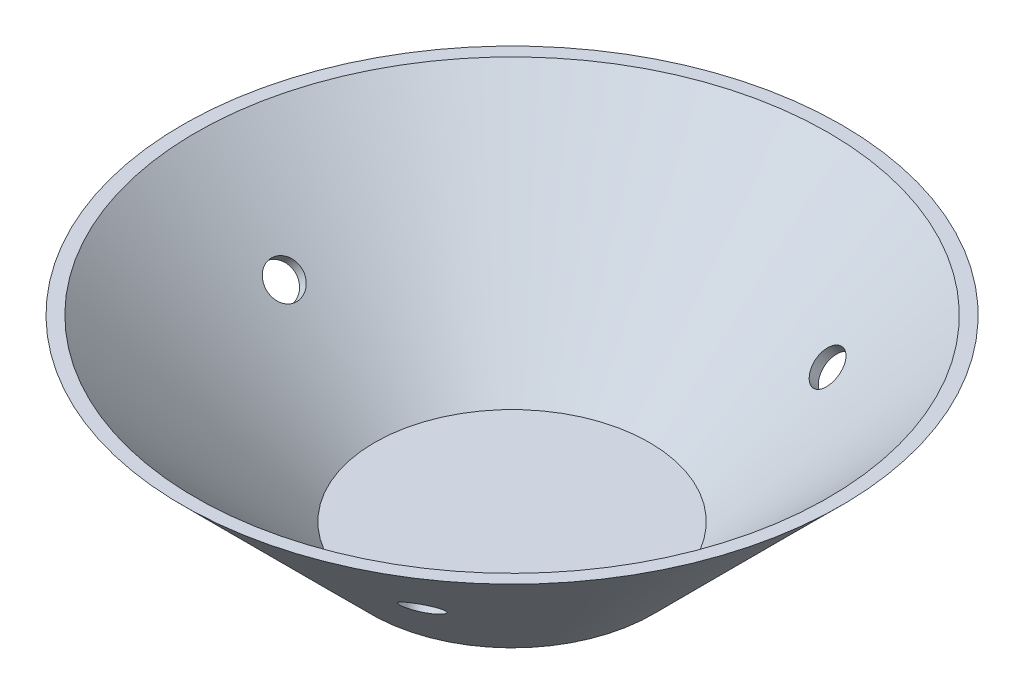
ISO-10303-21;
HEADER;
FILE_DESCRIPTION(('STEP AP214'),'2;1');
FILE_NAME('part.step','',(''),(''),'','','');
FILE_SCHEMA(('AUTOMOTIVE_DESIGN { 1 0 10303 214 1 1 1 1 }'));
ENDSEC;
DATA;
#1=APPLICATION_CONTEXT('core data for automotive mechanical design processes');
#2=APPLICATION_PROTOCOL_DEFINITION('international standard','automotive_design',2000,#1);
#3=PRODUCT_CONTEXT('',#1,'mechanical');
#4=PRODUCT('Part','Part','',(#3));
#5=PRODUCT_RELATED_PRODUCT_CATEGORY('part','',(#4));
#6=PRODUCT_DEFINITION_FORMATION('','',#4);
#7=PRODUCT_DEFINITION_CONTEXT('part definition',#1,'design');
#8=PRODUCT_DEFINITION('design','',#6,#7);
#9=PRODUCT_DEFINITION_SHAPE('','',#8);
#10=(LENGTH_UNIT() NAMED_UNIT(*) SI_UNIT(.MILLI.,.METRE.));
#11=(NAMED_UNIT(*) PLANE_ANGLE_UNIT() SI_UNIT($,.RADIAN.));
#12=(NAMED_UNIT(*) SI_UNIT($,.STERADIAN.) SOLID_ANGLE_UNIT());
#13=UNCERTAINTY_MEASURE_WITH_UNIT(LENGTH_MEASURE(1.E-05),#10,'distance_accuracy_value','');
#14=(GEOMETRIC_REPRESENTATION_CONTEXT(3) GLOBAL_UNCERTAINTY_ASSIGNED_CONTEXT((#13)) GLOBAL_UNIT_ASSIGNED_CONTEXT((#10,
#11,#12)) REPRESENTATION_CONTEXT('',''));
#15=CARTESIAN_POINT('',(0.,0.,0.));
#16=DIRECTION('',(0.,0.,1.));
#17=DIRECTION('',(1.,0.,0.));
#18=AXIS2_PLACEMENT_3D('',#15,#16,#17);
#19=CARTESIAN_POINT('',(0.,0.999999999999998,0.));
#20=DIRECTION('',(0.,1.,0.));
#21=DIRECTION('',(0.,0.,1.));
#22=AXIS2_PLACEMENT_3D('',#19,#20,#21);
#23=CONICAL_SURFACE('',#22,14.5857864376269,0.785398163397447);
#24=CARTESIAN_POINT('',(0.,20.0000000000001,0.));
#25=DIRECTION('',(0.,-1.,0.));
#26=DIRECTION('',(0.,0.,-1.));
#27=AXIS2_PLACEMENT_3D('',#24,#25,#26);
#28=CIRCLE('',#27,33.5857864376269);
#29=CARTESIAN_POINT('',(0.,20.0000000000001,-33.5857864376269));
#30=VERTEX_POINT('',#29);
#31=EDGE_CURVE('E124',#30,#30,#28,.T.);
#32=ORIENTED_EDGE('',*,*,#31,.F.);
#33=EDGE_LOOP('',(#32));
#34=FACE_BOUND('',#33,.T.);
#35=CARTESIAN_POINT('',(0.,0.999999999999998,0.));
#36=DIRECTION('',(0.,-1.,0.));
#37=DIRECTION('',(0.,0.,-1.));
#38=AXIS2_PLACEMENT_3D('',#35,#36,#37);
#39=CIRCLE('',#38,14.5857864376269);
#40=CARTESIAN_POINT('',(0.,0.999999999999998,-14.5857864376269));
#41=VERTEX_POINT('',#40);
#42=EDGE_CURVE('E59',#41,#41,#39,.T.);
#43=ORIENTED_EDGE('',*,*,#42,.T.);
#44=EDGE_LOOP('',(#43));
#45=FACE_BOUND('',#44,.T.);
#46=CARTESIAN_POINT('',(-24.6406632101769,11.1463477237175,-2.12512981659311));
#47=CARTESIAN_POINT('',(-24.7160014883639,11.2199276273625,-2.10791357112872));
#48=CARTESIAN_POINT('',(-24.7907268035602,11.2921626139646,-2.08179534083245));
#49=CARTESIAN_POINT('',(-24.9366835612137,11.4319394334571,-2.01247314817709));
#50=CARTESIAN_POINT('',(-25.0079107467096,11.4994755879025,-1.9692489212256));
#51=CARTESIAN_POINT('',(-25.144619165861,11.6279860245044,-1.86697497360349));
#52=CARTESIAN_POINT('',(-25.2101034431045,11.6889637863611,-1.80793370364531));
#53=CARTESIAN_POINT('',(-25.3333355262826,11.8028127804067,-1.67570718479709));
#54=CARTESIAN_POINT('',(-25.3910851723375,11.8556859411682,-1.60252531020735));
#55=CARTESIAN_POINT('',(-25.4971354689199,11.9520725626238,-1.44398544858415));
#56=CARTESIAN_POINT('',(-25.5454253114426,11.9955753230399,-1.35861372465481));
#57=CARTESIAN_POINT('',(-25.6309524995932,12.0720644304693,-1.17816867897611));
#58=CARTESIAN_POINT('',(-25.6681894345038,12.1050503866898,-1.08309499688602));
#59=CARTESIAN_POINT('',(-25.7304175810259,12.1596864627746,-0.885954256526392));
#60=CARTESIAN_POINT('',(-25.7554103217526,12.1813379981604,-0.783888073330468));
#61=CARTESIAN_POINT('',(-25.7923529970032,12.2127778112003,-0.57565094886943));
#62=CARTESIAN_POINT('',(-25.8043030639588,12.2225662093097,-0.469480049293872));
#63=CARTESIAN_POINT('',(-25.8147682044051,12.2300328280656,-0.256196930097104));
#64=CARTESIAN_POINT('',(-25.8133010175891,12.2277270408242,-0.149086140410133));
#65=CARTESIAN_POINT('',(-25.7970237210349,12.2110963352622,0.0631699352408192));
#66=CARTESIAN_POINT('',(-25.7822136916069,12.1967714892839,0.168315233031139));
#67=CARTESIAN_POINT('',(-25.7397454915866,12.1564645794543,0.373587559774491));
#68=CARTESIAN_POINT('',(-25.7120954677605,12.1304899075836,0.473717726182787));
#69=CARTESIAN_POINT('',(-25.6448395423253,12.0675213682537,0.666195528811332));
#70=CARTESIAN_POINT('',(-25.6052335663695,12.0305274322726,0.758543116632052));
#71=CARTESIAN_POINT('',(-25.5152908748846,11.9463996194509,0.932913549357739));
#72=CARTESIAN_POINT('',(-25.4649457465566,11.8992577927253,1.01492821911096));
#73=CARTESIAN_POINT('',(-25.355127902945,11.7960282264469,1.16622928382012));
#74=CARTESIAN_POINT('',(-25.2956551357129,11.7399404359796,1.23551560632996));
#75=CARTESIAN_POINT('',(-25.1693708282767,11.620186863828,1.3594558890414));
#76=CARTESIAN_POINT('',(-25.102552714183,11.5565142896334,1.41409658896311));
#77=CARTESIAN_POINT('',(-24.9636681446764,11.4232829308324,1.50711059354502));
#78=CARTESIAN_POINT('',(-24.8916017020724,11.3537241605915,1.54548393790483));
#79=CARTESIAN_POINT('',(-24.744415726692,11.2105942994111,1.60485901448494));
#80=CARTESIAN_POINT('',(-24.6692972557259,11.1370246008923,1.62586673487738));
#81=CARTESIAN_POINT('',(-24.5182004063865,10.9878606209172,1.64993159117321));
#82=CARTESIAN_POINT('',(-24.4422220341093,10.9122663538087,1.65298885425329));
#83=CARTESIAN_POINT('',(-24.2916681153418,10.7612514069812,1.6410709724919));
#84=CARTESIAN_POINT('',(-24.2170912647967,10.6858306297018,1.6261135289003));
#85=CARTESIAN_POINT('',(-24.0713477250766,10.5372622788592,1.57862300721274));
#86=CARTESIAN_POINT('',(-24.000181038252,10.4641147068626,1.54608991700415));
#87=CARTESIAN_POINT('',(-23.8631801933769,10.3222548108397,1.46437353170154));
#88=CARTESIAN_POINT('',(-23.79734626551,10.2535426782909,1.41518951836044));
#89=CARTESIAN_POINT('',(-23.6727334992302,10.1226419520853,1.30156791576522));
#90=CARTESIAN_POINT('',(-23.6139547161146,10.0604534095602,1.23713020696633));
#91=CARTESIAN_POINT('',(-23.5048781212092,9.94447284180611,1.09474926382435));
#92=CARTESIAN_POINT('',(-23.4545892801754,9.89068970240723,1.01679191827304));
#93=CARTESIAN_POINT('',(-23.3638000572129,9.7933143537513,0.849624282660688));
#94=CARTESIAN_POINT('',(-23.3232996890227,9.7497221587976,0.760413976805989));
#95=CARTESIAN_POINT('',(-23.2530488310601,9.67414359331489,0.57324992677246));
#96=CARTESIAN_POINT('',(-23.2233001949241,9.64215922401177,0.475294678561528));
#97=CARTESIAN_POINT('',(-23.1752613907972,9.59087020059524,0.273435838080664));
#98=CARTESIAN_POINT('',(-23.1569710995862,9.57156541012874,0.169532309790146));
#99=CARTESIAN_POINT('',(-23.1322897619927,9.54630066054537,-0.0411311826392583));
#100=CARTESIAN_POINT('',(-23.1258836012993,9.54032374899112,-0.147887343153997));
#101=CARTESIAN_POINT('',(-23.125074372337,9.54186466643781,-0.361347432163194));
#102=CARTESIAN_POINT('',(-23.1306712740167,9.54938246165285,-0.468051360787753));
#103=CARTESIAN_POINT('',(-23.1537361279564,9.57764625880995,-0.678308601460909));
#104=CARTESIAN_POINT('',(-23.171196507243,9.59838382147872,-0.78186387939939));
#105=CARTESIAN_POINT('',(-23.217583498148,9.65238209547604,-0.982967147123485));
#106=CARTESIAN_POINT('',(-23.2465102379633,9.6856429468182,-1.08051506973112));
#107=CARTESIAN_POINT('',(-23.3152074363689,9.7636407459605,-1.26697601762286));
#108=CARTESIAN_POINT('',(-23.3549921367573,9.8083927615051,-1.35587749263793));
#109=CARTESIAN_POINT('',(-23.4444460658853,9.90789881007118,-1.52238870611351));
#110=CARTESIAN_POINT('',(-23.494115007,9.96265255204513,-1.5999987730329));
#111=CARTESIAN_POINT('',(-23.6021930828224,10.0804970018177,-1.7418238446267));
#112=CARTESIAN_POINT('',(-23.6606125736432,10.1435975774536,-1.80602275892193));
#113=CARTESIAN_POINT('',(-23.784688724648,10.2761431383636,-1.91909657418103));
#114=CARTESIAN_POINT('',(-23.8503470911912,10.3455896188412,-1.96796785160749));
#115=CARTESIAN_POINT('',(-23.9871319774946,10.488671224635,-2.04895477394687));
#116=CARTESIAN_POINT('',(-24.0582566381059,10.5623049236337,-2.08107608703084));
#117=CARTESIAN_POINT('',(-24.2040057815208,10.711547341551,-2.12763431675563));
#118=CARTESIAN_POINT('',(-24.2786260115621,10.7871536133925,-2.14209217116957));
#119=CARTESIAN_POINT('',(-24.401512409187,10.9103471898132,-2.1509847124583));
#120=CARTESIAN_POINT('',(-24.4493758669092,10.9580107921798,-2.15082854992469));
#121=CARTESIAN_POINT('',(-24.5451290026286,11.0527447988014,-2.14334494051436));
#122=CARTESIAN_POINT('',(-24.5930186805736,11.0998152042363,-2.13601750790253));
#123=CARTESIAN_POINT('',(-24.6406632101769,11.1463477237175,-2.12512981659311));
#124=B_SPLINE_CURVE_WITH_KNOTS('',3,(#46,#47,#48,#49,#50,#51,#52,#53,#54,#55,#56,#57,#58,#59,
#60,#61,#62,#63,#64,#65,#66,#67,#68,#69,#70,#71,#72,#73,#74,#75,#76,#77,#78,#79,#80,#81,#82,#83,
#84,#85,#86,#87,#88,#89,#90,#91,#92,#93,#94,#95,#96,#97,#98,#99,#100,#101,#102,#103,#104,#105,
#106,#107,#108,#109,#110,#111,#112,#113,#114,#115,#116,#117,#118,#119,#120,#121,#122,#123),
.UNSPECIFIED.,.T.,.F.,(4,2,2,2,2,2,2,2,2,2,2,2,2,2,2,2,2,2,2,2,2,2,2,2,2,2,2,2,2,2,2,2,2,2,2,2,
2,2,4),(0.,0.319872641518887,0.640125359464447,0.96020731320374,1.28021298153569,
1.60058215693736,1.92096323551393,2.2413042931162,2.56164209802847,2.88155642790781,
3.20146883224698,3.52117853415364,3.8408902241748,4.1608532946686,4.48081818624356,
4.80107180577816,5.1213246437467,5.44146700310225,5.76160709428729,6.08143287230816,
6.40125887074421,6.72109866681558,7.04094096958695,7.36111914143838,7.68129776266862,
8.00153155751383,8.3217619085867,8.64158470875953,8.96140670821186,9.28102474295312,
9.60064635121295,9.920689221526,10.2407227801616,10.5611381296764,10.8816291701398,
11.2020116862619,11.5220140602218,11.7243044791195,11.9265944956271),.UNSPECIFIED.);
#125=CARTESIAN_POINT('',(-24.6406632101769,11.1463477237175,-2.12512981659311));
#126=VERTEX_POINT('',#125);
#127=EDGE_CURVE('E100',#126,#126,#124,.T.);
#128=ORIENTED_EDGE('',*,*,#127,.F.);
#129=EDGE_LOOP('',(#128));
#130=FACE_BOUND('',#129,.T.);
#131=CARTESIAN_POINT('',(10.7631548142962,10.0142025289661,-21.0027135786498));
#132=CARTESIAN_POINT('',(10.7964562252941,9.95568842487818,-20.9198973842503));
#133=CARTESIAN_POINT('',(10.8377644457191,9.90129935272991,-20.8372889073013));
#134=CARTESIAN_POINT('',(10.935148572984,9.80255573055032,-20.6747094184387));
#135=CARTESIAN_POINT('',(10.9912417316731,9.7582130162833,-20.5947416112701));
#136=CARTESIAN_POINT('',(11.1164780003269,9.68107492367805,-20.4396473107222));
#137=CARTESIAN_POINT('',(11.1856156624249,9.64827474107819,-20.3645188137758));
#138=CARTESIAN_POINT('',(11.3348983503981,9.59529919954497,-20.2210981279931));
#139=CARTESIAN_POINT('',(11.4150406135396,9.575120678952,-20.1528042307294));
#140=CARTESIAN_POINT('',(11.5839449512903,9.5480630095335,-20.0249402094871));
#141=CARTESIAN_POINT('',(11.6726995961413,9.54117250262804,-19.9653626753949));
#142=CARTESIAN_POINT('',(11.8563472096719,9.54088808151589,-19.8565228224839));
#143=CARTESIAN_POINT('',(11.9512403878444,9.54749462816573,-19.8072608559533));
#144=CARTESIAN_POINT('',(12.1444115944305,9.57396890941464,-19.7205113537954));
#145=CARTESIAN_POINT('',(12.2426871575029,9.59382717147199,-19.6830154357334));
#146=CARTESIAN_POINT('',(12.4399541059695,9.64612697565208,-19.6208909961924));
#147=CARTESIAN_POINT('',(12.5389454963387,9.67856860531309,-19.596262564231));
#148=CARTESIAN_POINT('',(12.7350481212108,9.75501027959446,-19.5606706310116));
#149=CARTESIAN_POINT('',(12.832156844819,9.79902475404479,-19.5497242882701));
#150=CARTESIAN_POINT('',(13.0217171176082,9.89716392287295,-19.5420174745805));
#151=CARTESIAN_POINT('',(13.1141686324618,9.95128869175784,-19.545257108179));
#152=CARTESIAN_POINT('',(13.2920204671441,10.0680085685393,-19.5660123858454));
#153=CARTESIAN_POINT('',(13.3774111493037,10.1306149558067,-19.5835471990275));
#154=CARTESIAN_POINT('',(13.5386676168755,10.2622936304871,-19.6325795930421));
#155=CARTESIAN_POINT('',(13.6145334409739,10.3313658916365,-19.6640771171615));
#156=CARTESIAN_POINT('',(13.7545983672173,10.4738234065959,-19.7402415891169));
#157=CARTESIAN_POINT('',(13.818805994098,10.5472054566026,-19.7848988510703));
#158=CARTESIAN_POINT('',(13.9338344553616,10.6961519226755,-19.8862042297921));
#159=CARTESIAN_POINT('',(13.9846554482665,10.7717163128871,-19.9428522045542));
#160=CARTESIAN_POINT('',(14.0713988379358,10.9227115977436,-20.0664448487817));
#161=CARTESIAN_POINT('',(14.1073470398466,10.9981424955798,-20.1333714052178));
#162=CARTESIAN_POINT('',(14.1634381023806,11.1468894444809,-20.2756649353063));
#163=CARTESIAN_POINT('',(14.1835809819677,11.2202054980832,-20.3510318988313));
#164=CARTESIAN_POINT('',(14.2074521664546,11.3627131162721,-20.5079776358902));
#165=CARTESIAN_POINT('',(14.2111836970591,11.4319054887442,-20.5895551855058));
#166=CARTESIAN_POINT('',(14.2020811515692,11.564352993575,-20.7565169831584));
#167=CARTESIAN_POINT('',(14.1892469168497,11.6276080690751,-20.8419012676393));
#168=CARTESIAN_POINT('',(14.1472726575498,11.7466431383146,-21.0140659362807));
#169=CARTESIAN_POINT('',(14.1181076227279,11.8024115035296,-21.1008482630432));
#170=CARTESIAN_POINT('',(14.044198734351,11.904948536192,-21.2730861214812));
#171=CARTESIAN_POINT('',(13.9994547693571,11.9517171392587,-21.3585416436614));
#172=CARTESIAN_POINT('',(13.895514566694,12.0351355531825,-21.5256651496538));
#173=CARTESIAN_POINT('',(13.8363026281306,12.0717742782232,-21.6073289032214));
#174=CARTESIAN_POINT('',(13.7050577430053,12.1339588244247,-21.7643327949097));
#175=CARTESIAN_POINT('',(13.6330248514327,12.1595046931614,-21.8396729601505));
#176=CARTESIAN_POINT('',(13.478181305731,12.1988607731502,-21.9817492691868));
#177=CARTESIAN_POINT('',(13.3953780044441,12.2126789427835,-22.0484912215751));
#178=CARTESIAN_POINT('',(13.2212784157884,12.2282679546661,-22.1714793606767));
#179=CARTESIAN_POINT('',(13.1299821964032,12.2300388933417,-22.2277256313943));
#180=CARTESIAN_POINT('',(12.9416140423425,12.2214934596457,-22.3280468676328));
#181=CARTESIAN_POINT('',(12.8445497695192,12.2111927960409,-22.3721375590579));
#182=CARTESIAN_POINT('',(12.647316603449,12.1787799801345,-22.4470295325776));
#183=CARTESIAN_POINT('',(12.5471477161742,12.1566678505523,-22.4778308402342));
#184=CARTESIAN_POINT('',(12.346605451029,12.1011764501114,-22.5253468731566));
#185=CARTESIAN_POINT('',(12.2462321013522,12.0677986402886,-22.5420634240793));
#186=CARTESIAN_POINT('',(12.0481725081464,11.9905962678603,-22.5610573522393));
#187=CARTESIAN_POINT('',(11.9504862877476,11.9467716153627,-22.5633346052259));
#188=CARTESIAN_POINT('',(11.7605408322208,11.8497137997724,-22.5535154492686));
#189=CARTESIAN_POINT('',(11.6682872840114,11.7964710031887,-22.5414042496729));
#190=CARTESIAN_POINT('',(11.4920091660602,11.6819506215153,-22.5032692556278));
#191=CARTESIAN_POINT('',(11.4079846431362,11.6206729907175,-22.4772453820301));
#192=CARTESIAN_POINT('',(11.2505785930225,11.4916208591642,-22.4121382728942));
#193=CARTESIAN_POINT('',(11.1772032817589,11.4238426020299,-22.3730474538208));
#194=CARTESIAN_POINT('',(11.0433107473688,11.2836085108876,-22.283036009861));
#195=CARTESIAN_POINT('',(10.9827929685019,11.211152879226,-22.2321158964707));
#196=CARTESIAN_POINT('',(10.8764282467531,11.0635851365316,-22.1200216910464));
#197=CARTESIAN_POINT('',(10.830569181937,10.9884752777817,-22.0588561355496));
#198=CARTESIAN_POINT('',(10.7547735148006,10.8376105851365,-21.9280003387537));
#199=CARTESIAN_POINT('',(10.7248406613018,10.7618556036474,-21.858308095128));
#200=CARTESIAN_POINT('',(10.6817620861031,10.6119186686516,-21.7124170364636));
#201=CARTESIAN_POINT('',(10.6686108139756,10.5377362030298,-21.6362203816282));
#202=CARTESIAN_POINT('',(10.6594264740268,10.3931508266263,-21.4794551257431));
#203=CARTESIAN_POINT('',(10.663373520218,10.3227436215507,-21.3988917110779));
#204=CARTESIAN_POINT('',(10.6836137909655,10.212407231779,-21.2653549131118));
#205=CARTESIAN_POINT('',(10.6948876557449,10.1707159756934,-21.2130179536155));
#206=CARTESIAN_POINT('',(10.7240826232487,10.0901959703532,-21.1079972577669));
#207=CARTESIAN_POINT('',(10.7420037300413,10.0513672228506,-21.0553135212025));
#208=CARTESIAN_POINT('',(10.7631548142962,10.0142025289661,-21.0027135786498));
#209=B_SPLINE_CURVE_WITH_KNOTS('',3,(#131,#132,#133,#134,#135,#136,#137,#138,#139,#140,#141,
#142,#143,#144,#145,#146,#147,#148,#149,#150,#151,#152,#153,#154,#155,#156,#157,#158,#159,#160,
#161,#162,#163,#164,#165,#166,#167,#168,#169,#170,#171,#172,#173,#174,#175,#176,#177,#178,#179,
#180,#181,#182,#183,#184,#185,#186,#187,#188,#189,#190,#191,#192,#193,#194,#195,#196,#197,#198,
#199,#200,#201,#202,#203,#204,#205,#206,#207,#208),.UNSPECIFIED.,.T.,.F.,(4,2,2,2,2,2,2,2,2,2,2,
2,2,2,2,2,2,2,2,2,2,2,2,2,2,2,2,2,2,2,2,2,2,2,2,2,2,2,4),(0.,0.319944646134239,
0.640264286171277,0.960450443827837,1.280556364391,1.60038854931185,1.92023165507677,
2.23984637634179,2.55946332109888,2.87948069213132,3.19950042160118,3.51994998860082,
3.84039825402522,4.16061124844833,4.48082045079843,4.8004717179616,5.12012260158986,
5.43971065397625,5.75930176659513,6.07938366954708,6.39946786215314,6.71990097055427,
7.04033270464522,7.3605468204698,7.68075837328903,8.00055369732659,8.32034840623932,
8.64010165719256,8.95985765963041,9.2799426407904,9.60002944291293,9.92030233414132,
10.2405613794193,10.5605548991455,10.8806237078673,11.2005866279023,11.5201775189929,
11.7233872876745,11.9265971807239),.UNSPECIFIED.);
#210=CARTESIAN_POINT('',(10.7631548142962,10.0142025289661,-21.0027135786498));
#211=VERTEX_POINT('',#210);
#212=EDGE_CURVE('E83',#211,#211,#209,.T.);
#213=ORIENTED_EDGE('',*,*,#212,.F.);
#214=EDGE_LOOP('',(#213));
#215=FACE_BOUND('',#214,.T.);
#216=CARTESIAN_POINT('',(11.1245196136692,9.55607693524186,20.2926317596712));
#217=CARTESIAN_POINT('',(11.0376041991586,9.5676628291696,20.353490702471));
#218=CARTESIAN_POINT('',(10.9546918287936,9.58591700028021,20.4189306291199));
#219=CARTESIAN_POINT('',(10.7993400907379,9.63517051936975,20.557172575829));
#220=CARTESIAN_POINT('',(10.7269132944552,9.6661849976919,20.6299832581153));
#221=CARTESIAN_POINT('',(10.5947635029709,9.739908443999,20.7809464353122));
#222=CARTESIAN_POINT('',(10.5350337681891,9.78261118019894,20.8590960670602));
#223=CARTESIAN_POINT('',(10.4300282929366,9.87831482792914,21.0186918929981));
#224=CARTESIAN_POINT('',(10.3847491132067,9.93131328422083,21.1001372975802));
#225=CARTESIAN_POINT('',(10.3099570366474,10.0459883765073,21.2642995264451));
#226=CARTESIAN_POINT('',(10.2804610315413,10.1076742212574,21.3470176158221));
#227=CARTESIAN_POINT('',(10.2382410038598,10.2377586670876,21.5114553334092));
#228=CARTESIAN_POINT('',(10.2255175413617,10.3061574922492,21.5931749281867));
#229=CARTESIAN_POINT('',(10.217290489413,10.4475361888111,21.7533678901349));
#230=CARTESIAN_POINT('',(10.2217762145585,10.5205131898806,21.8318432411079));
#231=CARTESIAN_POINT('',(10.247872916358,10.6689149072585,21.9834495175264));
#232=CARTESIAN_POINT('',(10.2694836656133,10.7443395910522,22.0565805139242));
#233=CARTESIAN_POINT('',(10.3291844015204,10.8953162378715,22.19532251268));
#234=CARTESIAN_POINT('',(10.3672453248966,10.9708677434192,22.2609465205718));
#235=CARTESIAN_POINT('',(10.4587467583969,11.1201058152539,22.3829392301114));
#236=CARTESIAN_POINT('',(10.5121872067401,11.1937923890312,22.4393079689369));
#237=CARTESIAN_POINT('',(10.6328671207094,11.3372639870171,22.5411103482336));
#238=CARTESIAN_POINT('',(10.7001020374635,11.4070502877539,22.5865475827801));
#239=CARTESIAN_POINT('',(10.8464129983559,11.5408974714668,22.6651268442923));
#240=CARTESIAN_POINT('',(10.92548916481,11.6049582952899,22.6982687442392));
#241=CARTESIAN_POINT('',(11.0932956396919,11.7257893178845,22.7512360981862));
#242=CARTESIAN_POINT('',(11.1820400879968,11.7825485663948,22.7710417357139));
#243=CARTESIAN_POINT('',(11.366495852365,11.8872269919258,22.7965590075556));
#244=CARTESIAN_POINT('',(11.4622072189484,11.9351461048343,22.8022705396573));
#245=CARTESIAN_POINT('',(11.6579293071373,12.0210001009055,22.7992968174492));
#246=CARTESIAN_POINT('',(11.7579449628674,12.0589231504444,22.7905945876583));
#247=CARTESIAN_POINT('',(11.95926507873,12.1237718465333,22.7588815513586));
#248=CARTESIAN_POINT('',(12.0605695344713,12.1506975305423,22.7358707935881));
#249=CARTESIAN_POINT('',(12.2614776778452,12.1928757060978,22.6761132892754));
#250=CARTESIAN_POINT('',(12.3610823228938,12.2081349961747,22.6393745612493));
#251=CARTESIAN_POINT('',(12.5557857290612,12.226629940711,22.5531446079942));
#252=CARTESIAN_POINT('',(12.6508845287872,12.2298656982095,22.5036534920543));
#253=CARTESIAN_POINT('',(12.8337390277422,12.2242358757019,22.3933867726461));
#254=CARTESIAN_POINT('',(12.921504268,12.2153862874163,22.3326261732057));
#255=CARTESIAN_POINT('',(13.0873570879117,12.1858284122881,22.2015354246214));
#256=CARTESIAN_POINT('',(13.1654446817825,12.1651201428666,22.1312052895358));
#257=CARTESIAN_POINT('',(13.3097535077226,12.1123569278395,21.9830624836622));
#258=CARTESIAN_POINT('',(13.3759773908798,12.0803045219924,21.9052514905483));
#259=CARTESIAN_POINT('',(13.4947701609722,12.005639995612,21.7444451325447));
#260=CARTESIAN_POINT('',(13.5473389590905,11.9630278063983,21.6614497339384));
#261=CARTESIAN_POINT('',(13.6374583713061,11.8682528468256,21.4926678237484));
#262=CARTESIAN_POINT('',(13.6749939071953,11.8160805638316,21.4068786027531));
#263=CARTESIAN_POINT('',(13.7339921336801,11.7035272141326,21.2351579367661));
#264=CARTESIAN_POINT('',(13.7554547489893,11.6431461089786,21.1492264911101));
#265=CARTESIAN_POINT('',(13.7817859261821,11.5156827169235,20.9797387396421));
#266=CARTESIAN_POINT('',(13.7866439342232,11.448596195945,20.8961839778839));
#267=CARTESIAN_POINT('',(13.7796640707946,11.3095171429269,20.7340001248586));
#268=CARTESIAN_POINT('',(13.7678262979143,11.2375246398598,20.6553710045081));
#269=CARTESIAN_POINT('',(13.7278521425755,11.0906252009903,20.5054139255536));
#270=CARTESIAN_POINT('',(13.699726649512,11.015720243534,20.434081126341));
#271=CARTESIAN_POINT('',(13.6280092023995,10.8650272320585,20.3007318108635));
#272=CARTESIAN_POINT('',(13.5844173129231,10.7892391817275,20.2387152557045));
#273=CARTESIAN_POINT('',(13.4830480252213,10.6390043994656,20.1258048054964));
#274=CARTESIAN_POINT('',(13.4252826381802,10.5645565888049,20.074901561255));
#275=CARTESIAN_POINT('',(13.2971562408302,10.4191129118176,19.9855356386981));
#276=CARTESIAN_POINT('',(13.2267951633595,10.3481170638999,19.9470730267207));
#277=CARTESIAN_POINT('',(13.0753793929342,10.2116767402071,19.8835556236146));
#278=CARTESIAN_POINT('',(12.9943199196677,10.1462347676471,19.85850685158));
#279=CARTESIAN_POINT('',(12.8237480594602,10.022953352005,19.8224081759143));
#280=CARTESIAN_POINT('',(12.7342359286974,9.96511367864376,19.8113578481727));
#281=CARTESIAN_POINT('',(12.5491088522146,9.85880830331228,19.8033996740111));
#282=CARTESIAN_POINT('',(12.453488430392,9.81035117423262,19.8065046984509));
#283=CARTESIAN_POINT('',(12.258804317966,9.72443140660897,19.8266408631011));
#284=CARTESIAN_POINT('',(12.1597398094105,9.68697140004942,19.8436753334138));
#285=CARTESIAN_POINT('',(11.9609116904614,9.62429092711801,19.8910467579214));
#286=CARTESIAN_POINT('',(11.8611479627634,9.59907256686249,19.9213859994304));
#287=CARTESIAN_POINT('',(11.6637897314542,9.56175443376267,19.9943826244368));
#288=CARTESIAN_POINT('',(11.566192797644,9.54963915243238,20.0370253698773));
#289=CARTESIAN_POINT('',(11.410925824132,9.54085297399604,20.1155856658814));
#290=CARTESIAN_POINT('',(11.3517678573122,9.5401416614266,20.1482123599289));
#291=CARTESIAN_POINT('',(11.2360462027054,9.54409034802529,20.2174926571033));
#292=CARTESIAN_POINT('',(11.1794825101851,9.5487503373929,20.2541462528826));
#293=CARTESIAN_POINT('',(11.1245196136692,9.55607693524186,20.2926317596712));
#294=B_SPLINE_CURVE_WITH_KNOTS('',3,(#216,#217,#218,#219,#220,#221,#222,#223,#224,#225,#226,
#227,#228,#229,#230,#231,#232,#233,#234,#235,#236,#237,#238,#239,#240,#241,#242,#243,#244,#245,
#246,#247,#248,#249,#250,#251,#252,#253,#254,#255,#256,#257,#258,#259,#260,#261,#262,#263,#264,
#265,#266,#267,#268,#269,#270,#271,#272,#273,#274,#275,#276,#277,#278,#279,#280,#281,#282,#283,
#284,#285,#286,#287,#288,#289,#290,#291,#292,#293),.UNSPECIFIED.,.T.,.F.,(4,2,2,2,2,2,2,2,2,2,2,
2,2,2,2,2,2,2,2,2,2,2,2,2,2,2,2,2,2,2,2,2,2,2,2,2,2,2,4),(0.,0.319957992587326,
0.640296468988953,0.96046448329194,1.28055624008091,1.60098988890088,1.92143423753578,
2.24167965040241,2.56192081088412,2.88159848472195,3.20127487440384,3.52084601635636,
3.84042045958991,4.16046871962227,4.48051930068161,4.80094708213819,5.12137377214783,
5.44161359254574,5.76185066854977,6.08166440683029,6.40147767528549,6.72121938825623,
7.04096318087169,7.36102687490121,7.68109206811368,8.00136065608616,8.32162735286555,
8.64168017742156,8.96173166576378,9.28151286090014,9.60129576120188,9.92122203535949,
10.2411386164846,10.5613461421382,10.8816302419522,11.2019694255918,11.5219290472303,
11.7242619731249,11.9265945298419),.UNSPECIFIED.);
#295=CARTESIAN_POINT('',(11.1245196136692,9.55607693524186,20.2926317596712));
#296=VERTEX_POINT('',#295);
#297=EDGE_CURVE('E89',#296,#296,#294,.T.);
#298=ORIENTED_EDGE('',*,*,#297,.F.);
#299=EDGE_LOOP('',(#298));
#300=FACE_BOUND('',#299,.T.);
#301=ADVANCED_FACE('F39',(#34,#45,#130,#215,#300),#23,.F.);
#302=CARTESIAN_POINT('',(0.,0.,0.));
#303=DIRECTION('',(0.,1.,0.));
#304=DIRECTION('',(0.,0.,1.));
#305=AXIS2_PLACEMENT_3D('',#302,#303,#304);
#306=CONICAL_SURFACE('',#305,15.,0.785398163397447);
#307=CARTESIAN_POINT('',(0.,20.0000000000001,0.));
#308=DIRECTION('',(0.,-1.,0.));
#309=DIRECTION('',(0.,0.,-1.));
#310=AXIS2_PLACEMENT_3D('',#307,#308,#309);
#311=CIRCLE('',#310,35.);
#312=CARTESIAN_POINT('',(0.,20.0000000000001,-35.));
#313=VERTEX_POINT('',#312);
#314=EDGE_CURVE('E122',#313,#313,#311,.T.);
#315=ORIENTED_EDGE('',*,*,#314,.T.);
#316=EDGE_LOOP('',(#315));
#317=FACE_BOUND('',#316,.T.);
#318=CARTESIAN_POINT('',(0.,0.,0.));
#319=DIRECTION('',(0.,-1.,0.));
#320=DIRECTION('',(0.,0.,-1.));
#321=AXIS2_PLACEMENT_3D('',#318,#319,#320);
#322=CIRCLE('',#321,15.);
#323=CARTESIAN_POINT('',(0.,0.,-15.));
#324=VERTEX_POINT('',#323);
#325=EDGE_CURVE('E106',#324,#324,#322,.T.);
#326=ORIENTED_EDGE('',*,*,#325,.F.);
#327=EDGE_LOOP('',(#326));
#328=FACE_BOUND('',#327,.T.);
#329=CARTESIAN_POINT('',(-24.5067615542216,9.58236650500407,-1.92649451358445));
#330=CARTESIAN_POINT('',(-24.5713811709504,9.65071620835305,-1.97663357337165));
#331=CARTESIAN_POINT('',(-24.6392963558056,9.72185372297221,-2.01888453093729));
#332=CARTESIAN_POINT('',(-24.779890409143,9.86754922322285,-2.08633947774065));
#333=CARTESIAN_POINT('',(-24.8525746754706,9.94211105498011,-2.11152377200943));
#334=CARTESIAN_POINT('',(-25.0006302092819,10.0923978736637,-2.14406625148622));
#335=CARTESIAN_POINT('',(-25.0760003303882,10.1681223566748,-2.15143195171102));
#336=CARTESIAN_POINT('',(-25.2272913104499,10.3185836234659,-2.14814137906352));
#337=CARTESIAN_POINT('',(-25.3032120339838,10.3933206381532,-2.137489397355));
#338=CARTESIAN_POINT('',(-25.4533867846047,10.5397317494322,-2.09848769076295));
#339=CARTESIAN_POINT('',(-25.5276414194214,10.6114069717716,-2.07014453139495));
#340=CARTESIAN_POINT('',(-25.6723129517023,10.7497995212083,-1.99657464131461));
#341=CARTESIAN_POINT('',(-25.7427296777622,10.8165166269198,-1.95134715723999));
#342=CARTESIAN_POINT('',(-25.8776762068944,10.9433165008803,-1.84523310637841));
#343=CARTESIAN_POINT('',(-25.9421991823311,11.0033915911908,-1.78432868263408));
#344=CARTESIAN_POINT('',(-26.0632900638213,11.115280570958,-1.64861119764719));
#345=CARTESIAN_POINT('',(-26.1198579154295,11.1670944038745,-1.57379804122055));
#346=CARTESIAN_POINT('',(-26.2233530770206,11.2612215438971,-1.41226560515193));
#347=CARTESIAN_POINT('',(-26.2702671629805,11.3035218263235,-1.32553026168922));
#348=CARTESIAN_POINT('',(-26.3528796390305,11.3774773315303,-1.14268628635125));
#349=CARTESIAN_POINT('',(-26.3885780610707,11.4091325846351,-1.04657768117855));
#350=CARTESIAN_POINT('',(-26.4476167140187,11.4610091307015,-0.847731346428968));
#351=CARTESIAN_POINT('',(-26.4709595006956,11.4812327883529,-0.744994992741477));
#352=CARTESIAN_POINT('',(-26.5045488374761,11.5097561016068,-0.535793767678413));
#353=CARTESIAN_POINT('',(-26.5147954808105,11.5180558420952,-0.429328922851323));
#354=CARTESIAN_POINT('',(-26.5218587068375,11.5225222695006,-0.215836956220553));
#355=CARTESIAN_POINT('',(-26.5186922927904,11.5187043191267,-0.108810717965915));
#356=CARTESIAN_POINT('',(-26.4990722279773,11.4990605315875,0.102895792574225));
#357=CARTESIAN_POINT('',(-26.4826186273951,11.4832347397741,0.207576073718515));
#358=CARTESIAN_POINT('',(-26.4369682968885,11.4399739255007,0.411564611082538));
#359=CARTESIAN_POINT('',(-26.4077781253949,11.412544878116,0.510875602564834));
#360=CARTESIAN_POINT('',(-26.3375912694372,11.3467532150768,0.701371357600119));
#361=CARTESIAN_POINT('',(-26.2965945210013,11.3083905401806,0.792556077118859));
#362=CARTESIAN_POINT('',(-26.204056870709,11.2216475921818,0.964290431887982));
#363=CARTESIAN_POINT('',(-26.1525075253163,11.1732592968185,1.04483146526541));
#364=CARTESIAN_POINT('',(-26.0405011873362,11.0676984451311,1.19291457158215));
#365=CARTESIAN_POINT('',(-25.9800441468392,11.0105258415609,1.26045657460222));
#366=CARTESIAN_POINT('',(-25.8520403185231,10.8888053016399,1.38067824010762));
#367=CARTESIAN_POINT('',(-25.7844878731268,10.8242514761234,1.43334591710254));
#368=CARTESIAN_POINT('',(-25.6443944755368,10.6894892527972,1.52224949964953));
#369=CARTESIAN_POINT('',(-25.5718535380782,10.6192808716897,1.55848545373483));
#370=CARTESIAN_POINT('',(-25.4239888611744,10.4751152400355,1.61348112956622));
#371=CARTESIAN_POINT('',(-25.3486662617338,10.4011595207315,1.63224792981956));
#372=CARTESIAN_POINT('',(-25.1974240375056,10.2515025359937,1.65179362165624));
#373=CARTESIAN_POINT('',(-25.121504416671,10.1758012821114,1.65257263224353));
#374=CARTESIAN_POINT('',(-24.9713146886887,10.0248568477473,1.63612783263503));
#375=CARTESIAN_POINT('',(-24.8970431460174,9.94961331367188,1.61892037262263));
#376=CARTESIAN_POINT('',(-24.7521462283882,9.80169034541291,1.56701909009579));
#377=CARTESIAN_POINT('',(-24.6815208595478,9.72901091553152,1.53232523824319));
#378=CARTESIAN_POINT('',(-24.5458123385209,9.58836267336121,1.44643354863876));
#379=CARTESIAN_POINT('',(-24.4807299188187,9.52039448386914,1.39523353391055));
#380=CARTESIAN_POINT('',(-24.357814507343,9.39124465842963,1.27778384956076));
#381=CARTESIAN_POINT('',(-24.299981562671,9.33006306657669,1.21153408216512));
#382=CARTESIAN_POINT('',(-24.1929708841066,9.21633355376214,1.06578622660358));
#383=CARTESIAN_POINT('',(-24.1438018321201,9.16379429656785,0.98627500293165));
#384=CARTESIAN_POINT('',(-24.05539648217,9.06909902879555,0.816301043274071));
#385=CARTESIAN_POINT('',(-24.0161602034066,9.02694303828851,0.725838286119478));
#386=CARTESIAN_POINT('',(-23.9485591503546,8.95438506670218,0.536518253097159));
#387=CARTESIAN_POINT('',(-23.9201950009636,8.92398376124628,0.437660495108603));
#388=CARTESIAN_POINT('',(-23.8750109473049,8.87594643767718,0.23436285739957));
#389=CARTESIAN_POINT('',(-23.8581909568965,8.85831032431203,0.129923019337974));
#390=CARTESIAN_POINT('',(-23.8365019132145,8.83640719087782,-0.0814368618631023));
#391=CARTESIAN_POINT('',(-23.8316183552071,8.83212394312887,-0.18835373527041));
#392=CARTESIAN_POINT('',(-23.8338756492357,8.83702265385594,-0.401746762288691));
#393=CARTESIAN_POINT('',(-23.8410160052924,8.84620405692096,-0.50822293389674));
#394=CARTESIAN_POINT('',(-23.8671504823618,8.87770946355656,-0.717653116621351));
#395=CARTESIAN_POINT('',(-23.8861376044324,8.90002570676393,-0.820609169531399));
#396=CARTESIAN_POINT('',(-23.9355312446187,8.95705863152517,-1.020181383567));
#397=CARTESIAN_POINT('',(-23.9659406219959,8.9917784178737,-1.11679595014837));
#398=CARTESIAN_POINT('',(-24.0375247626064,9.07254154382445,-1.30108835850105));
#399=CARTESIAN_POINT('',(-24.0787184567414,9.11860478732571,-1.38875010445086));
#400=CARTESIAN_POINT('',(-24.1708354183143,9.22050771337176,-1.55239733057241));
#401=CARTESIAN_POINT('',(-24.2217473281354,9.27633597728899,-1.62839625579946));
#402=CARTESIAN_POINT('',(-24.3120012694721,9.37426245869032,-1.74154839114706));
#403=CARTESIAN_POINT('',(-24.348849888856,9.41400443215756,-1.782798138507));
#404=CARTESIAN_POINT('',(-24.4256052227418,9.49624110592021,-1.85926819446079));
#405=CARTESIAN_POINT('',(-24.4655119421911,9.53873581066893,-1.89448849329996));
#406=CARTESIAN_POINT('',(-24.5067615542216,9.58236650500407,-1.92649451358445));
#407=B_SPLINE_CURVE_WITH_KNOTS('',3,(#329,#330,#331,#332,#333,#334,#335,#336,#337,#338,#339,
#340,#341,#342,#343,#344,#345,#346,#347,#348,#349,#350,#351,#352,#353,#354,#355,#356,#357,#358,
#359,#360,#361,#362,#363,#364,#365,#366,#367,#368,#369,#370,#371,#372,#373,#374,#375,#376,#377,
#378,#379,#380,#381,#382,#383,#384,#385,#386,#387,#388,#389,#390,#391,#392,#393,#394,#395,#396,
#397,#398,#399,#400,#401,#402,#403,#404,#405,#406),.UNSPECIFIED.,.T.,.F.,(4,2,2,2,2,2,2,2,2,2,2,
2,2,2,2,2,2,2,2,2,2,2,2,2,2,2,2,2,2,2,2,2,2,2,2,2,2,2,4),(0.,0.319520563076359,
0.639409228564506,0.959162957024627,1.27884054236958,1.59839956007054,1.91797283789118,
2.237911751867,2.55785285541761,2.87822934864245,3.19860492920458,3.51891421400048,
3.83922121851803,4.15912230272607,4.47902217872206,4.79875752300788,5.11849459975477,
5.43848851741328,5.75848415620852,6.07873691136828,6.39898872061361,6.71911070715413,
7.03923057582525,7.35905969982173,7.67888936041996,7.99876122020532,8.31863515816866,
8.6388278344445,8.95902112965165,9.27923282585646,9.59944213266532,9.91926213848031,
10.23906895223,10.5586870062197,10.8783851215703,11.1986482458336,11.5185393471966,
11.7225033848503,11.9264677524818),.UNSPECIFIED.);
#408=CARTESIAN_POINT('',(-24.5067615542216,9.58236650500407,-1.92649451358445));
#409=VERTEX_POINT('',#408);
#410=EDGE_CURVE('E55',#409,#409,#407,.T.);
#411=ORIENTED_EDGE('',*,*,#410,.T.);
#412=EDGE_LOOP('',(#411));
#413=FACE_BOUND('',#412,.T.);
#414=CARTESIAN_POINT('',(11.0257208831668,9.83291197824814,-22.2509998949692));
#415=CARTESIAN_POINT('',(11.0152525569808,9.75948644502921,-22.1742421418053));
#416=CARTESIAN_POINT('',(11.0132886385129,9.68750145648755,-22.0948407843784));
#417=CARTESIAN_POINT('',(11.0264143854684,9.54861081856238,-21.9329486517469));
#418=CARTESIAN_POINT('',(11.0415242739074,9.4817112928985,-21.8504543250795));
#419=CARTESIAN_POINT('',(11.0882995398023,9.3551309847122,-21.6846816186006));
#420=CARTESIAN_POINT('',(11.1199566459247,9.2954466139404,-21.6014036509065));
#421=CARTESIAN_POINT('',(11.1988273629542,9.18514941231816,-21.4362551078508));
#422=CARTESIAN_POINT('',(11.2460372164523,9.13453439494599,-21.3543841975779));
#423=CARTESIAN_POINT('',(11.3546146146023,9.04395306679382,-21.1941432845682));
#424=CARTESIAN_POINT('',(11.4159891925445,9.00399206742817,-21.1157750441834));
#425=CARTESIAN_POINT('',(11.5510627701577,8.93605854157694,-20.9646595607593));
#426=CARTESIAN_POINT('',(11.6247621544369,8.90808638931258,-20.8919124932382));
#427=CARTESIAN_POINT('',(11.7822554040518,8.86508120973349,-20.7540605592392));
#428=CARTESIAN_POINT('',(11.866040290525,8.85003676892975,-20.6889489955588));
#429=CARTESIAN_POINT('',(12.0413362872229,8.83334906214585,-20.5680822777314));
#430=CARTESIAN_POINT('',(12.1328473242095,8.83170566914821,-20.5123270349085));
#431=CARTESIAN_POINT('',(12.3208860460706,8.8418671641046,-20.4118036333157));
#432=CARTESIAN_POINT('',(12.4174082820128,8.85365772529051,-20.3670238315179));
#433=CARTESIAN_POINT('',(12.6128498242357,8.89026529980361,-20.2896898202494));
#434=CARTESIAN_POINT('',(12.711769138295,8.91508235540713,-20.2571356504565));
#435=CARTESIAN_POINT('',(12.909331074295,8.97693768593211,-20.2052519157444));
#436=CARTESIAN_POINT('',(13.0079734661321,9.01398414730666,-20.1859312361317));
#437=CARTESIAN_POINT('',(13.2022102537503,9.09908164201601,-20.1612293705723));
#438=CARTESIAN_POINT('',(13.2978046140327,9.14713280346261,-20.1558483469137));
#439=CARTESIAN_POINT('',(13.4834836708315,9.2527808511996,-20.1593378692351));
#440=CARTESIAN_POINT('',(13.5735596798553,9.31039228492086,-20.1682303161421));
#441=CARTESIAN_POINT('',(13.7455830592307,9.43329655404875,-20.200218274841));
#442=CARTESIAN_POINT('',(13.8275304361235,9.49858938327387,-20.2233137752033));
#443=CARTESIAN_POINT('',(13.9810468999759,9.63484542234547,-20.283197335227));
#444=CARTESIAN_POINT('',(14.0526163778206,9.70580841846798,-20.3199848789892));
#445=CARTESIAN_POINT('',(14.1833992731576,9.85127216176295,-20.406316890385));
#446=CARTESIAN_POINT('',(14.2426128226112,9.92577287114217,-20.4558612217635));
#447=CARTESIAN_POINT('',(14.346940013011,10.0760018704114,-20.5662662944984));
#448=CARTESIAN_POINT('',(14.3920764205131,10.1517279676381,-20.6271085071413));
#449=CARTESIAN_POINT('',(14.4670985145892,10.3023651577718,-20.7584389121123));
#450=CARTESIAN_POINT('',(14.4969842813905,10.3772762549641,-20.8289270536947));
#451=CARTESIAN_POINT('',(14.5406167900621,10.5241448954698,-20.9774408722724));
#452=CARTESIAN_POINT('',(14.5543764928792,10.596104765807,-21.05546044139));
#453=CARTESIAN_POINT('',(14.5653689185545,10.7351969089363,-21.216787651317));
#454=CARTESIAN_POINT('',(14.5626015261028,10.8023291480425,-21.3000953290176));
#455=CARTESIAN_POINT('',(14.5405459111253,10.9300768218568,-21.4696210209773));
#456=CARTESIAN_POINT('',(14.5212393205843,10.9906849267559,-21.5558421685622));
#457=CARTESIAN_POINT('',(14.4665539477055,11.1037439983947,-21.7285356885982));
#458=CARTESIAN_POINT('',(14.4311750239543,11.1561948933573,-21.8150080632529));
#459=CARTESIAN_POINT('',(14.3452048161327,11.2516851497737,-21.9857436870835));
#460=CARTESIAN_POINT('',(14.294592423277,11.2947113076454,-22.0700036933213));
#461=CARTESIAN_POINT('',(14.179529443256,11.3701861226073,-22.2336734144886));
#462=CARTESIAN_POINT('',(14.1150788604851,11.4026347830564,-22.3130831309582));
#463=CARTESIAN_POINT('',(13.9741122855368,11.4561472379142,-22.4646811891276));
#464=CARTESIAN_POINT('',(13.897598040157,11.4772126786414,-22.5368705738495));
#465=CARTESIAN_POINT('',(13.7346262347159,11.5074448703403,-22.6719130550736));
#466=CARTESIAN_POINT('',(13.6481687653185,11.5166117297956,-22.7347662366927));
#467=CARTESIAN_POINT('',(13.4678646126828,11.5228153667553,-22.8492392980702));
#468=CARTESIAN_POINT('',(13.3740273828499,11.5198674227386,-22.9008732403541));
#469=CARTESIAN_POINT('',(13.1815411600397,11.5019461303683,-22.9915497924798));
#470=CARTESIAN_POINT('',(13.0828921763277,11.4869728051695,-23.0305924265659));
#471=CARTESIAN_POINT('',(12.883672583182,11.4453790085676,-23.0950119935365));
#472=CARTESIAN_POINT('',(12.7831030934838,11.418765137072,-23.1203966520006));
#473=CARTESIAN_POINT('',(12.5828892312482,11.3545460893786,-23.1569067611013));
#474=CARTESIAN_POINT('',(12.483244865125,11.3169408370324,-23.1680321129466));
#475=CARTESIAN_POINT('',(12.2876908965318,11.2316368631316,-23.1758322039627));
#476=CARTESIAN_POINT('',(12.1917843042072,11.183930197666,-23.1724955295214));
#477=CARTESIAN_POINT('',(12.006583574435,11.0796392183138,-23.1515768316155));
#478=CARTESIAN_POINT('',(11.9172892232883,11.0230551915164,-23.1339952687466));
#479=CARTESIAN_POINT('',(11.7478534018271,10.9024055956618,-23.0852053140592));
#480=CARTESIAN_POINT('',(11.6677186686917,10.8383345888632,-23.0539869723165));
#481=CARTESIAN_POINT('',(11.5190068392179,10.7043932602972,-22.9789203262793));
#482=CARTESIAN_POINT('',(11.4504325116304,10.6345215552088,-22.9350690031418));
#483=CARTESIAN_POINT('',(11.3268717194879,10.4908586821914,-22.8360891249112));
#484=CARTESIAN_POINT('',(11.271886674547,10.4170671057477,-22.7809593927097));
#485=CARTESIAN_POINT('',(11.1771656941621,10.267646517018,-22.6610942893844));
#486=CARTESIAN_POINT('',(11.1374118262383,10.1920197776617,-22.5963703393954));
#487=CARTESIAN_POINT('',(11.0858378750956,10.0688140090943,-22.4844305449349));
#488=CARTESIAN_POINT('',(11.0691207321758,10.0211326166797,-22.4395123528748));
#489=CARTESIAN_POINT('',(11.0423742911111,9.92641254246215,-22.3470822405529));
#490=CARTESIAN_POINT('',(11.0323449839378,9.87937385979155,-22.2995703237928));
#491=CARTESIAN_POINT('',(11.0257208831668,9.83291197824814,-22.2509998949692));
#492=B_SPLINE_CURVE_WITH_KNOTS('',3,(#414,#415,#416,#417,#418,#419,#420,#421,#422,#423,#424,
#425,#426,#427,#428,#429,#430,#431,#432,#433,#434,#435,#436,#437,#438,#439,#440,#441,#442,#443,
#444,#445,#446,#447,#448,#449,#450,#451,#452,#453,#454,#455,#456,#457,#458,#459,#460,#461,#462,
#463,#464,#465,#466,#467,#468,#469,#470,#471,#472,#473,#474,#475,#476,#477,#478,#479,#480,#481,
#482,#483,#484,#485,#486,#487,#488,#489,#490,#491),.UNSPECIFIED.,.T.,.F.,(4,2,2,2,2,2,2,2,2,2,2,
2,2,2,2,2,2,2,2,2,2,2,2,2,2,2,2,2,2,2,2,2,2,2,2,2,2,2,4),(0.,0.319962454628187,
0.640304285363473,0.960486142144637,1.28059070242104,1.60085454928129,1.92112839216552,
2.24111918350057,2.56110694190308,2.8807537654753,3.20040162643983,3.52026389738555,
3.8401298922141,4.16048715235117,4.48084415468716,4.80118908759054,5.12153059903326,
5.44135131216072,5.76117034282924,6.08073214976736,6.4002961862965,6.72021558333539,
7.04013779525776,7.36050537556451,7.68087285414005,8.00119398658834,8.32151219853321,
8.64142656800118,8.9613403214756,9.28107292625554,9.60080774619551,9.92079495078332,
10.2407718092843,10.5609825263357,10.8812698261708,11.201590570918,11.5215330174478,
11.7239977062626,11.9264621217534),.UNSPECIFIED.);
#493=CARTESIAN_POINT('',(11.0257208831668,9.83291197824814,-22.2509998949692));
#494=VERTEX_POINT('',#493);
#495=EDGE_CURVE('E51',#494,#494,#492,.T.);
#496=ORIENTED_EDGE('',*,*,#495,.T.);
#497=EDGE_LOOP('',(#496));
#498=FACE_BOUND('',#497,.T.);
#499=CARTESIAN_POINT('',(10.6677600984239,9.33724601682697,21.8746528696122));
#500=CARTESIAN_POINT('',(10.6355944159753,9.39708190820709,21.9569116798307));
#501=CARTESIAN_POINT('',(10.6114612593122,9.46096371984752,22.0394660617725));
#502=CARTESIAN_POINT('',(10.5800881145036,9.59483364143622,22.202928652005));
#503=CARTESIAN_POINT('',(10.5728677461773,9.6648287456624,22.2838348405955));
#504=CARTESIAN_POINT('',(10.5756351217665,9.80874674769378,22.4417227136367));
#505=CARTESIAN_POINT('',(10.5856160840119,9.88266808643546,22.5187059324096));
#506=CARTESIAN_POINT('',(10.6225356289395,10.0322614010929,22.6666289304288));
#507=CARTESIAN_POINT('',(10.6494700309763,10.1079329409865,22.7375701947));
#508=CARTESIAN_POINT('',(10.7194995387471,10.2587947019195,22.8713586788054));
#509=CARTESIAN_POINT('',(10.762577747394,10.333985342898,22.9342142695189));
#510=CARTESIAN_POINT('',(10.8636546081783,10.4818715088082,23.0501024232492));
#511=CARTESIAN_POINT('',(10.9216538349168,10.5545669375282,23.1031346078361));
#512=CARTESIAN_POINT('',(11.0508764916066,10.6954890998138,23.1977957810968));
#513=CARTESIAN_POINT('',(11.1220998478532,10.7637158582826,23.2394248333227));
#514=CARTESIAN_POINT('',(11.2756868959545,10.8939028904429,23.3099975452463));
#515=CARTESIAN_POINT('',(11.3580506705353,10.9558631175947,23.338941110738));
#516=CARTESIAN_POINT('',(11.5316462776603,11.0720112477797,23.3832322609291));
#517=CARTESIAN_POINT('',(11.6228913497189,11.1261872395789,23.3985591916852));
#518=CARTESIAN_POINT('',(11.8114839378793,11.2252847568015,23.4149717056421));
#519=CARTESIAN_POINT('',(11.9088314791735,11.2702062440167,23.4160572300469));
#520=CARTESIAN_POINT('',(12.1068899111935,11.3497095579409,23.4038174504034));
#521=CARTESIAN_POINT('',(12.2076037137366,11.384282161319,23.390479339983));
#522=CARTESIAN_POINT('',(12.409391734104,11.4421763347263,23.3496346132154));
#523=CARTESIAN_POINT('',(12.5104659505488,11.4654979477727,23.3221280510411));
#524=CARTESIAN_POINT('',(12.7099777243286,11.5002999543997,23.2536700448635));
#525=CARTESIAN_POINT('',(12.8084172739172,11.5117895563861,23.2127290891142));
#526=CARTESIAN_POINT('',(12.9999169908036,11.522674775105,23.118516193187));
#527=CARTESIAN_POINT('',(13.0929772014225,11.5220704892465,23.0652443523305));
#528=CARTESIAN_POINT('',(13.2709639508634,11.5087886571709,22.9479562398527));
#529=CARTESIAN_POINT('',(13.3558999865779,11.4961254020892,22.8839527603089));
#530=CARTESIAN_POINT('',(13.5153775403081,11.4590555069848,22.7470194974339));
#531=CARTESIAN_POINT('',(13.5899190558722,11.4346488641925,22.6740897119976));
#532=CARTESIAN_POINT('',(13.7265447313114,11.3746912871999,22.5214544642743));
#533=CARTESIAN_POINT('',(13.7886286036527,11.3391400958217,22.4417488456553));
#534=CARTESIAN_POINT('',(13.8986477166374,11.2577730610096,22.2779336621196));
#535=CARTESIAN_POINT('',(13.946582862737,11.211957148989,22.1938240677792));
#536=CARTESIAN_POINT('',(14.0270681762302,11.1111544535825,22.0236256026372));
#537=CARTESIAN_POINT('',(14.0596027665344,11.0561584605912,21.9375348198098));
#538=CARTESIAN_POINT('',(14.1083741385714,10.9384250733187,21.7660324710698));
#539=CARTESIAN_POINT('',(14.1246108746521,10.8756876573533,21.6806209070603));
#540=CARTESIAN_POINT('',(14.1404027231268,10.7440690222111,21.512993042051));
#541=CARTESIAN_POINT('',(14.1399509302468,10.6751852716032,21.4307780778051));
#542=CARTESIAN_POINT('',(14.1224200401244,10.5331251238074,21.2720255854373));
#543=CARTESIAN_POINT('',(14.1053410381617,10.45994875122,21.1954880247845));
#544=CARTESIAN_POINT('',(14.0551001475763,10.3113555353363,21.0503980610043));
#545=CARTESIAN_POINT('',(14.0219506906748,10.2359404661067,20.9818395362381));
#546=CARTESIAN_POINT('',(13.9405321392847,10.0849260913175,20.8546178316206));
#547=CARTESIAN_POINT('',(13.8922631084276,10.0093267865346,20.7959546101259));
#548=CARTESIAN_POINT('',(13.7820033776103,9.86016636568667,20.6902035841838));
#549=CARTESIAN_POINT('',(13.7200217474431,9.78660393840766,20.643108171799));
#550=CARTESIAN_POINT('',(13.5840381253459,9.64363191958424,20.5617038221345));
#551=CARTESIAN_POINT('',(13.5100360887661,9.57422234346684,20.5273949323516));
#552=CARTESIAN_POINT('',(13.3519955724193,9.44161151378647,20.4724004786277));
#553=CARTESIAN_POINT('',(13.2679510766398,9.37841402335224,20.451723129588));
#554=CARTESIAN_POINT('',(13.0921557602461,9.26023009830456,20.4244614960764));
#555=CARTESIAN_POINT('',(13.0004048770263,9.20524373040702,20.4178773261068));
#556=CARTESIAN_POINT('',(12.8116176327918,9.105180455981,20.4188289441007));
#557=CARTESIAN_POINT('',(12.7145768124362,9.06011207653554,20.4263768296379));
#558=CARTESIAN_POINT('',(12.5179425102463,8.9814055310331,20.4552496384094));
#559=CARTESIAN_POINT('',(12.4183490345909,8.94776733731135,20.4765745282985));
#560=CARTESIAN_POINT('',(12.2194142513774,8.89304567665174,20.5322539128554));
#561=CARTESIAN_POINT('',(12.1200728400955,8.87195573015819,20.5666016678599));
#562=CARTESIAN_POINT('',(11.9243693273602,8.84300895698474,20.6472631830956));
#563=CARTESIAN_POINT('',(11.8280070855349,8.83515150588368,20.693576378577));
#564=CARTESIAN_POINT('',(11.6411072059588,8.8329315960052,20.7967456375407));
#565=CARTESIAN_POINT('',(11.5505619287179,8.838551049774,20.8535874759535));
#566=CARTESIAN_POINT('',(11.3777139436313,8.8630600863744,20.9762806867432));
#567=CARTESIAN_POINT('',(11.2954132440744,8.88195289351208,21.0421342450782));
#568=CARTESIAN_POINT('',(11.1414057188979,8.93238884604054,21.1810872193374));
#569=CARTESIAN_POINT('',(11.0697061755416,8.9639406325332,21.2541915589799));
#570=CARTESIAN_POINT('',(10.9391192093674,9.03863437878686,21.4056116861606));
#571=CARTESIAN_POINT('',(10.8802170711295,9.08176289775337,21.4839213513928));
#572=CARTESIAN_POINT('',(10.7956637918016,9.16066251785696,21.6146710181754));
#573=CARTESIAN_POINT('',(10.765700543124,9.19343011612046,21.6661942441473));
#574=CARTESIAN_POINT('',(10.7119920668937,9.26266672309572,21.7699893019416));
#575=CARTESIAN_POINT('',(10.6882468510109,9.29913573875404,21.8222611351687));
#576=CARTESIAN_POINT('',(10.6677600984239,9.33724601682697,21.8746528696122));
#577=B_SPLINE_CURVE_WITH_KNOTS('',3,(#499,#500,#501,#502,#503,#504,#505,#506,#507,#508,#509,
#510,#511,#512,#513,#514,#515,#516,#517,#518,#519,#520,#521,#522,#523,#524,#525,#526,#527,#528,
#529,#530,#531,#532,#533,#534,#535,#536,#537,#538,#539,#540,#541,#542,#543,#544,#545,#546,#547,
#548,#549,#550,#551,#552,#553,#554,#555,#556,#557,#558,#559,#560,#561,#562,#563,#564,#565,#566,
#567,#568,#569,#570,#571,#572,#573,#574,#575,#576),.UNSPECIFIED.,.T.,.F.,(4,2,2,2,2,2,2,2,2,2,2,
2,2,2,2,2,2,2,2,2,2,2,2,2,2,2,2,2,2,2,2,2,2,2,2,2,2,2,4),(0.,0.319804750818604,
0.639980310431119,0.960029668856798,1.28000013539051,1.59963663255485,1.91928544060772,
2.23893246714916,2.55858186744041,2.8787152936408,3.19885004151944,3.51926926230508,
3.8396872579808,4.15985569557593,4.48002155440596,4.79980845490996,5.11959543083507,
5.43938978688702,5.75918627980492,6.0793055474447,6.39942571177401,6.71967833488345,
7.03992912284238,7.35993256678316,7.67993466398971,7.99972573471236,8.31951799332106,
8.63950279554867,8.95949019753306,9.2797516460737,9.60001231947167,9.92010747557792,
10.2401875264613,10.5598382359938,10.8795666205655,11.1995136261506,11.5190907622875,
11.7227782954384,11.9264662108622),.UNSPECIFIED.);
#578=CARTESIAN_POINT('',(10.6677600984239,9.33724601682697,21.8746528696122));
#579=VERTEX_POINT('',#578);
#580=EDGE_CURVE('E10',#579,#579,#577,.T.);
#581=ORIENTED_EDGE('',*,*,#580,.T.);
#582=EDGE_LOOP('',(#581));
#583=FACE_BOUND('',#582,.T.);
#584=ADVANCED_FACE('F70',(#317,#328,#413,#498,#583),#306,.T.);
#585=CARTESIAN_POINT('',(0.,0.999999999999999,0.));
#586=DIRECTION('',(0.,-1.,0.));
#587=DIRECTION('',(0.,0.,-1.));
#588=AXIS2_PLACEMENT_3D('',#585,#586,#587);
#589=PLANE('',#588);
#590=ORIENTED_EDGE('',*,*,#42,.F.);
#591=EDGE_LOOP('',(#590));
#592=FACE_BOUND('',#591,.T.);
#593=ADVANCED_FACE('F41',(#592),#589,.F.);
#594=CARTESIAN_POINT('',(0.,20.0000000000001,0.));
#595=DIRECTION('',(0.,1.,0.));
#596=DIRECTION('',(0.,0.,1.));
#597=AXIS2_PLACEMENT_3D('',#594,#595,#596);
#598=PLANE('',#597);
#599=ORIENTED_EDGE('',*,*,#31,.T.);
#600=EDGE_LOOP('',(#599));
#601=FACE_BOUND('',#600,.T.);
#602=ORIENTED_EDGE('',*,*,#314,.F.);
#603=EDGE_LOOP('',(#602));
#604=FACE_BOUND('',#603,.T.);
#605=ADVANCED_FACE('F97',(#601,#604),#598,.T.);
#606=CARTESIAN_POINT('',(0.,0.,0.));
#607=DIRECTION('',(0.,-1.,0.));
#608=DIRECTION('',(0.,0.,-1.));
#609=AXIS2_PLACEMENT_3D('',#606,#607,#608);
#610=PLANE('',#609);
#611=ORIENTED_EDGE('',*,*,#325,.T.);
#612=EDGE_LOOP('',(#611));
#613=FACE_BOUND('',#612,.T.);
#614=ADVANCED_FACE('F110',(#613),#610,.T.);
#615=CARTESIAN_POINT('',(9.82321446432155,45.1767855356786,-0.250012502187992));
#616=DIRECTION('',(-0.707106781186548,-0.707106781186547,0.));
#617=DIRECTION('',(0.707106781186547,-0.707106781186548,0.));
#618=AXIS2_PLACEMENT_3D('',#615,#616,#617);
#619=CYLINDRICAL_SURFACE('',#618,1.9);
#620=ORIENTED_EDGE('',*,*,#410,.F.);
#621=EDGE_LOOP('',(#620));
#622=FACE_BOUND('',#621,.T.);
#623=ORIENTED_EDGE('',*,*,#127,.T.);
#624=EDGE_LOOP('',(#623));
#625=FACE_BOUND('',#624,.T.);
#626=ADVANCED_FACE('F78',(#622,#625),#619,.F.);
#627=CARTESIAN_POINT('',(-7.89781233711594,51.5822301019062,14.1794372409054));
#628=DIRECTION('',(0.353553390593268,-0.707106781186547,-0.612372435695799));
#629=DIRECTION('',(0.,0.65465367070798,-0.755928946018452));
#630=AXIS2_PLACEMENT_3D('',#627,#628,#629);
#631=CYLINDRICAL_SURFACE('',#630,1.9);
#632=ORIENTED_EDGE('',*,*,#495,.F.);
#633=EDGE_LOOP('',(#632));
#634=FACE_BOUND('',#633,.T.);
#635=ORIENTED_EDGE('',*,*,#212,.T.);
#636=EDGE_LOOP('',(#635));
#637=FACE_BOUND('',#636,.T.);
#638=ADVANCED_FACE('F74',(#634,#637),#631,.F.);
#639=CARTESIAN_POINT('',(-8.33084669343321,51.5822301019063,-13.9294247387174));
#640=DIRECTION('',(0.353553390593277,-0.707106781186547,0.612372435695793));
#641=DIRECTION('',(0.,-0.654653670707977,-0.755928946018455));
#642=AXIS2_PLACEMENT_3D('',#639,#640,#641);
#643=CYLINDRICAL_SURFACE('',#642,1.9);
#644=ORIENTED_EDGE('',*,*,#580,.F.);
#645=EDGE_LOOP('',(#644));
#646=FACE_BOUND('',#645,.T.);
#647=ORIENTED_EDGE('',*,*,#297,.T.);
#648=EDGE_LOOP('',(#647));
#649=FACE_BOUND('',#648,.T.);
#650=ADVANCED_FACE('F77',(#646,#649),#643,.F.);
#651=CLOSED_SHELL('',(#301,#584,#593,#605,#614,#626,#638,#650));
#652=MANIFOLD_SOLID_BREP('B2',#651);
#653=ADVANCED_BREP_SHAPE_REPRESENTATION('',(#18,#652),#14);
#654=SHAPE_DEFINITION_REPRESENTATION(#9,#653);
ENDSEC;
END-ISO-10303-21;
